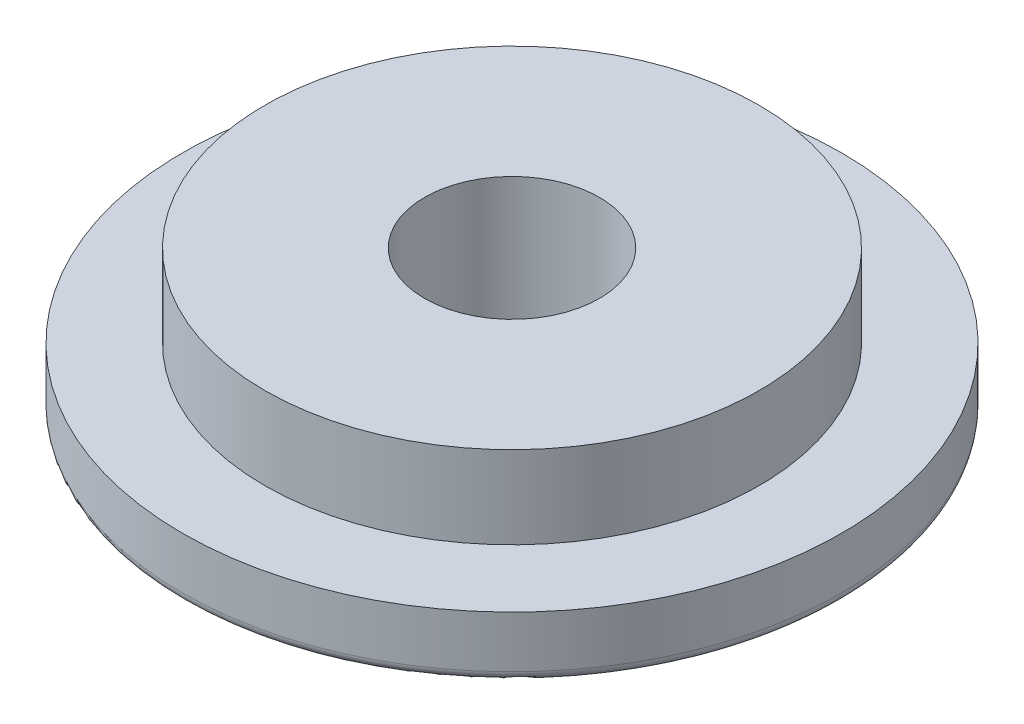
ISO-10303-21;
HEADER;
FILE_DESCRIPTION(('STEP AP214'),'2;1');
FILE_NAME('part.step','',(''),(''),'','','');
FILE_SCHEMA(('AUTOMOTIVE_DESIGN { 1 0 10303 214 1 1 1 1 }'));
ENDSEC;
DATA;
#1=APPLICATION_CONTEXT('core data for automotive mechanical design processes');
#2=APPLICATION_PROTOCOL_DEFINITION('international standard','automotive_design',2000,#1);
#3=PRODUCT_CONTEXT('',#1,'mechanical');
#4=PRODUCT('Part','Part','',(#3));
#5=PRODUCT_RELATED_PRODUCT_CATEGORY('part','',(#4));
#6=PRODUCT_DEFINITION_FORMATION('','',#4);
#7=PRODUCT_DEFINITION_CONTEXT('part definition',#1,'design');
#8=PRODUCT_DEFINITION('design','',#6,#7);
#9=PRODUCT_DEFINITION_SHAPE('','',#8);
#10=(LENGTH_UNIT() NAMED_UNIT(*) SI_UNIT(.MILLI.,.METRE.));
#11=(NAMED_UNIT(*) PLANE_ANGLE_UNIT() SI_UNIT($,.RADIAN.));
#12=(NAMED_UNIT(*) SI_UNIT($,.STERADIAN.) SOLID_ANGLE_UNIT());
#13=UNCERTAINTY_MEASURE_WITH_UNIT(LENGTH_MEASURE(1.E-05),#10,'distance_accuracy_value','');
#14=(GEOMETRIC_REPRESENTATION_CONTEXT(3) GLOBAL_UNCERTAINTY_ASSIGNED_CONTEXT((#13)) GLOBAL_UNIT_ASSIGNED_CONTEXT((#10,
#11,#12)) REPRESENTATION_CONTEXT('',''));
#15=CARTESIAN_POINT('',(0.,0.,0.));
#16=DIRECTION('',(0.,0.,1.));
#17=DIRECTION('',(1.,0.,0.));
#18=AXIS2_PLACEMENT_3D('',#15,#16,#17);
#19=CARTESIAN_POINT('',(24.60625,0.,0.));
#20=DIRECTION('',(0.,1.,0.));
#21=DIRECTION('',(0.,0.,1.));
#22=AXIS2_PLACEMENT_3D('',#19,#20,#21);
#23=PLANE('',#22);
#24=CARTESIAN_POINT('',(0.,0.,0.));
#25=DIRECTION('',(0.,1.,0.));
#26=DIRECTION('',(0.,0.,1.));
#27=AXIS2_PLACEMENT_3D('',#24,#25,#26);
#28=CIRCLE('',#27,6.746875);
#29=CARTESIAN_POINT('',(0.,0.,6.746875));
#30=VERTEX_POINT('',#29);
#31=EDGE_CURVE('E57',#30,#30,#28,.T.);
#32=ORIENTED_EDGE('',*,*,#31,.T.);
#33=EDGE_LOOP('',(#32));
#34=FACE_BOUND('',#33,.T.);
#35=CARTESIAN_POINT('',(0.,0.,0.));
#36=DIRECTION('',(0.,1.,0.));
#37=DIRECTION('',(0.,0.,1.));
#38=AXIS2_PLACEMENT_3D('',#35,#36,#37);
#39=CIRCLE('',#38,24.60625);
#40=CARTESIAN_POINT('',(0.,0.,24.60625));
#41=VERTEX_POINT('',#40);
#42=EDGE_CURVE('E10',#41,#41,#39,.T.);
#43=ORIENTED_EDGE('',*,*,#42,.F.);
#44=EDGE_LOOP('',(#43));
#45=FACE_BOUND('',#44,.T.);
#46=ADVANCED_FACE('F35',(#34,#45),#23,.F.);
#47=CARTESIAN_POINT('',(0.,0.79375,0.));
#48=DIRECTION('',(0.,1.,0.));
#49=DIRECTION('',(0.,0.,1.));
#50=AXIS2_PLACEMENT_3D('',#47,#48,#49);
#51=TOROIDAL_SURFACE('',#50,24.60625,0.79375);
#52=CARTESIAN_POINT('',(0.,0.79375000000001,0.));
#53=DIRECTION('',(0.,1.,0.));
#54=DIRECTION('',(0.,0.,1.));
#55=AXIS2_PLACEMENT_3D('',#52,#53,#54);
#56=CIRCLE('',#55,25.4);
#57=CARTESIAN_POINT('',(0.,0.79375000000001,25.4));
#58=VERTEX_POINT('',#57);
#59=EDGE_CURVE('E41',#58,#58,#56,.T.);
#60=ORIENTED_EDGE('',*,*,#59,.F.);
#61=EDGE_LOOP('',(#60));
#62=FACE_BOUND('',#61,.T.);
#63=ORIENTED_EDGE('',*,*,#42,.T.);
#64=EDGE_LOOP('',(#63));
#65=FACE_BOUND('',#64,.T.);
#66=ADVANCED_FACE('F92',(#62,#65),#51,.T.);
#67=CARTESIAN_POINT('',(0.,140.214345547224,0.));
#68=DIRECTION('',(0.,1.,0.));
#69=DIRECTION('',(0.,0.,1.));
#70=AXIS2_PLACEMENT_3D('',#67,#68,#69);
#71=CYLINDRICAL_SURFACE('',#70,25.4);
#72=CARTESIAN_POINT('',(0.,4.77520000000001,0.));
#73=DIRECTION('',(0.,1.,0.));
#74=DIRECTION('',(0.,0.,1.));
#75=AXIS2_PLACEMENT_3D('',#72,#73,#74);
#76=CIRCLE('',#75,25.4);
#77=CARTESIAN_POINT('',(0.,4.77520000000001,25.4));
#78=VERTEX_POINT('',#77);
#79=EDGE_CURVE('E45',#78,#78,#76,.T.);
#80=ORIENTED_EDGE('',*,*,#79,.F.);
#81=EDGE_LOOP('',(#80));
#82=FACE_BOUND('',#81,.T.);
#83=ORIENTED_EDGE('',*,*,#59,.T.);
#84=EDGE_LOOP('',(#83));
#85=FACE_BOUND('',#84,.T.);
#86=ADVANCED_FACE('F87',(#82,#85),#71,.T.);
#87=CARTESIAN_POINT('',(19.05,4.7752,0.));
#88=DIRECTION('',(0.,-1.,0.));
#89=DIRECTION('',(0.,0.,-1.));
#90=AXIS2_PLACEMENT_3D('',#87,#88,#89);
#91=PLANE('',#90);
#92=CARTESIAN_POINT('',(0.,4.77520000000001,0.));
#93=DIRECTION('',(0.,1.,0.));
#94=DIRECTION('',(0.,0.,1.));
#95=AXIS2_PLACEMENT_3D('',#92,#93,#94);
#96=CIRCLE('',#95,19.05);
#97=CARTESIAN_POINT('',(0.,4.77520000000001,19.05));
#98=VERTEX_POINT('',#97);
#99=EDGE_CURVE('E49',#98,#98,#96,.T.);
#100=ORIENTED_EDGE('',*,*,#99,.F.);
#101=EDGE_LOOP('',(#100));
#102=FACE_BOUND('',#101,.T.);
#103=ORIENTED_EDGE('',*,*,#79,.T.);
#104=EDGE_LOOP('',(#103));
#105=FACE_BOUND('',#104,.T.);
#106=ADVANCED_FACE('F81',(#102,#105),#91,.F.);
#107=CARTESIAN_POINT('',(0.,140.214345547224,0.));
#108=DIRECTION('',(0.,1.,0.));
#109=DIRECTION('',(0.,0.,1.));
#110=AXIS2_PLACEMENT_3D('',#107,#108,#109);
#111=CYLINDRICAL_SURFACE('',#110,19.05);
#112=CARTESIAN_POINT('',(0.,11.1252,0.));
#113=DIRECTION('',(0.,1.,0.));
#114=DIRECTION('',(0.,0.,1.));
#115=AXIS2_PLACEMENT_3D('',#112,#113,#114);
#116=CIRCLE('',#115,19.05);
#117=CARTESIAN_POINT('',(0.,11.1252,19.05));
#118=VERTEX_POINT('',#117);
#119=EDGE_CURVE('E54',#118,#118,#116,.T.);
#120=ORIENTED_EDGE('',*,*,#119,.F.);
#121=EDGE_LOOP('',(#120));
#122=FACE_BOUND('',#121,.T.);
#123=ORIENTED_EDGE('',*,*,#99,.T.);
#124=EDGE_LOOP('',(#123));
#125=FACE_BOUND('',#124,.T.);
#126=ADVANCED_FACE('F75',(#122,#125),#111,.T.);
#127=CARTESIAN_POINT('',(0.,11.1252,0.));
#128=DIRECTION('',(0.,-1.,0.));
#129=DIRECTION('',(0.,0.,-1.));
#130=AXIS2_PLACEMENT_3D('',#127,#128,#129);
#131=PLANE('',#130);
#132=CARTESIAN_POINT('',(0.,11.1252,0.));
#133=DIRECTION('',(0.,1.,0.));
#134=DIRECTION('',(0.,0.,1.));
#135=AXIS2_PLACEMENT_3D('',#132,#133,#134);
#136=CIRCLE('',#135,6.746875);
#137=CARTESIAN_POINT('',(0.,11.1252,6.746875));
#138=VERTEX_POINT('',#137);
#139=EDGE_CURVE('E58',#138,#138,#136,.T.);
#140=ORIENTED_EDGE('',*,*,#139,.F.);
#141=EDGE_LOOP('',(#140));
#142=FACE_BOUND('',#141,.T.);
#143=ORIENTED_EDGE('',*,*,#119,.T.);
#144=EDGE_LOOP('',(#143));
#145=FACE_BOUND('',#144,.T.);
#146=ADVANCED_FACE('F69',(#142,#145),#131,.F.);
#147=CARTESIAN_POINT('',(0.,0.,0.));
#148=DIRECTION('',(0.,1.,0.));
#149=DIRECTION('',(0.,0.,1.));
#150=AXIS2_PLACEMENT_3D('',#147,#148,#149);
#151=CYLINDRICAL_SURFACE('',#150,6.746875);
#152=ORIENTED_EDGE('',*,*,#31,.F.);
#153=EDGE_LOOP('',(#152));
#154=FACE_BOUND('',#153,.T.);
#155=ORIENTED_EDGE('',*,*,#139,.T.);
#156=EDGE_LOOP('',(#155));
#157=FACE_BOUND('',#156,.T.);
#158=ADVANCED_FACE('F66',(#154,#157),#151,.F.);
#159=CLOSED_SHELL('',(#46,#66,#86,#106,#126,#146,#158));
#160=MANIFOLD_SOLID_BREP('B2',#159);
#161=ADVANCED_BREP_SHAPE_REPRESENTATION('',(#18,#160),#14);
#162=SHAPE_DEFINITION_REPRESENTATION(#9,#161);
ENDSEC;
END-ISO-10303-21;
